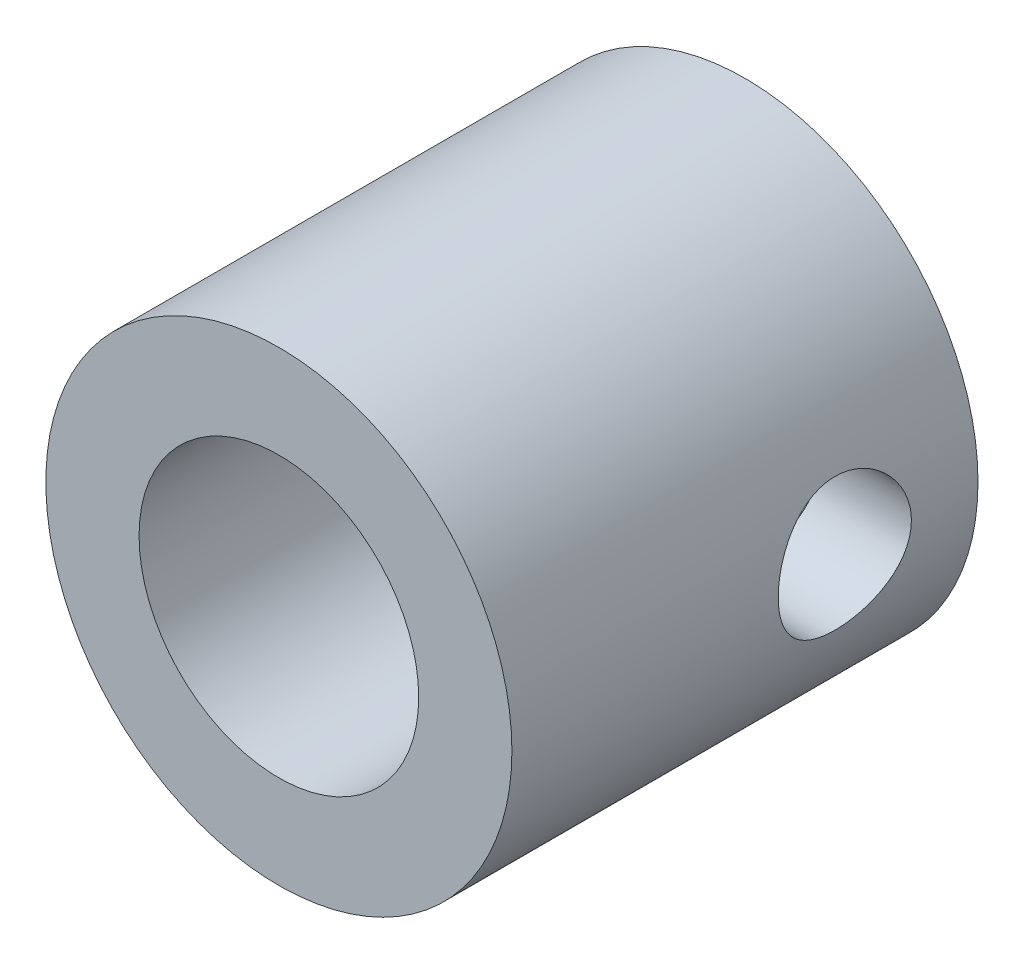
ISO-10303-21;
HEADER;
FILE_DESCRIPTION(('STEP AP214'),'2;1');
FILE_NAME('part.step','',(''),(''),'','','');
FILE_SCHEMA(('AUTOMOTIVE_DESIGN { 1 0 10303 214 1 1 1 1 }'));
ENDSEC;
DATA;
#1=APPLICATION_CONTEXT('core data for automotive mechanical design processes');
#2=APPLICATION_PROTOCOL_DEFINITION('international standard','automotive_design',2000,#1);
#3=PRODUCT_CONTEXT('',#1,'mechanical');
#4=PRODUCT('Part','Part','',(#3));
#5=PRODUCT_RELATED_PRODUCT_CATEGORY('part','',(#4));
#6=PRODUCT_DEFINITION_FORMATION('','',#4);
#7=PRODUCT_DEFINITION_CONTEXT('part definition',#1,'design');
#8=PRODUCT_DEFINITION('design','',#6,#7);
#9=PRODUCT_DEFINITION_SHAPE('','',#8);
#10=(LENGTH_UNIT() NAMED_UNIT(*) SI_UNIT(.MILLI.,.METRE.));
#11=(NAMED_UNIT(*) PLANE_ANGLE_UNIT() SI_UNIT($,.RADIAN.));
#12=(NAMED_UNIT(*) SI_UNIT($,.STERADIAN.) SOLID_ANGLE_UNIT());
#13=UNCERTAINTY_MEASURE_WITH_UNIT(LENGTH_MEASURE(1.E-05),#10,'distance_accuracy_value','');
#14=(GEOMETRIC_REPRESENTATION_CONTEXT(3) GLOBAL_UNCERTAINTY_ASSIGNED_CONTEXT((#13)) GLOBAL_UNIT_ASSIGNED_CONTEXT((#10,
#11,#12)) REPRESENTATION_CONTEXT('',''));
#15=CARTESIAN_POINT('',(0.,0.,0.));
#16=DIRECTION('',(0.,0.,1.));
#17=DIRECTION('',(1.,0.,0.));
#18=AXIS2_PLACEMENT_3D('',#15,#16,#17);
#19=CARTESIAN_POINT('',(0.,0.,7.));
#20=DIRECTION('',(0.,0.,1.));
#21=DIRECTION('',(1.,0.,0.));
#22=AXIS2_PLACEMENT_3D('',#19,#20,#21);
#23=PLANE('',#22);
#24=CARTESIAN_POINT('',(0.,0.,7.));
#25=DIRECTION('',(0.,0.,1.));
#26=DIRECTION('',(1.,0.,0.));
#27=AXIS2_PLACEMENT_3D('',#24,#25,#26);
#28=CIRCLE('',#27,3.5);
#29=CARTESIAN_POINT('',(3.5,0.,7.));
#30=VERTEX_POINT('',#29);
#31=EDGE_CURVE('E10',#30,#30,#28,.T.);
#32=ORIENTED_EDGE('',*,*,#31,.T.);
#33=EDGE_LOOP('',(#32));
#34=FACE_BOUND('',#33,.T.);
#35=CARTESIAN_POINT('',(0.,0.,7.));
#36=DIRECTION('',(0.,0.,1.));
#37=DIRECTION('',(1.,0.,0.));
#38=AXIS2_PLACEMENT_3D('',#35,#36,#37);
#39=CIRCLE('',#38,2.1);
#40=CARTESIAN_POINT('',(2.1,0.,7.));
#41=VERTEX_POINT('',#40);
#42=EDGE_CURVE('E49',#41,#41,#39,.T.);
#43=ORIENTED_EDGE('',*,*,#42,.F.);
#44=EDGE_LOOP('',(#43));
#45=FACE_BOUND('',#44,.T.);
#46=ADVANCED_FACE('F30',(#34,#45),#23,.T.);
#47=CARTESIAN_POINT('',(0.,0.,0.));
#48=DIRECTION('',(0.,0.,1.));
#49=DIRECTION('',(1.,0.,0.));
#50=AXIS2_PLACEMENT_3D('',#47,#48,#49);
#51=PLANE('',#50);
#52=CARTESIAN_POINT('',(0.,0.,0.));
#53=DIRECTION('',(0.,0.,1.));
#54=DIRECTION('',(1.,0.,0.));
#55=AXIS2_PLACEMENT_3D('',#52,#53,#54);
#56=CIRCLE('',#55,3.5);
#57=CARTESIAN_POINT('',(3.5,0.,0.));
#58=VERTEX_POINT('',#57);
#59=EDGE_CURVE('E44',#58,#58,#56,.T.);
#60=ORIENTED_EDGE('',*,*,#59,.F.);
#61=EDGE_LOOP('',(#60));
#62=FACE_BOUND('',#61,.T.);
#63=CARTESIAN_POINT('',(0.,0.,0.));
#64=DIRECTION('',(0.,0.,1.));
#65=DIRECTION('',(1.,0.,0.));
#66=AXIS2_PLACEMENT_3D('',#63,#64,#65);
#67=CIRCLE('',#66,2.1);
#68=CARTESIAN_POINT('',(2.1,0.,0.));
#69=VERTEX_POINT('',#68);
#70=EDGE_CURVE('E52',#69,#69,#67,.T.);
#71=ORIENTED_EDGE('',*,*,#70,.T.);
#72=EDGE_LOOP('',(#71));
#73=FACE_BOUND('',#72,.T.);
#74=ADVANCED_FACE('F88',(#62,#73),#51,.F.);
#75=CARTESIAN_POINT('',(0.,0.,7.));
#76=DIRECTION('',(0.,0.,-1.));
#77=DIRECTION('',(-1.,0.,0.));
#78=AXIS2_PLACEMENT_3D('',#75,#76,#77);
#79=CYLINDRICAL_SURFACE('',#78,3.5);
#80=CARTESIAN_POINT('',(3.5,0.,1.));
#81=CARTESIAN_POINT('',(3.49999934647171,-0.0549774511886257,1.00000096978097));
#82=CARTESIAN_POINT('',(3.49869208701023,-0.109964873936291,1.00454889448806));
#83=CARTESIAN_POINT('',(3.49360452972549,-0.218345995598494,1.02258213505116));
#84=CARTESIAN_POINT('',(3.48982329605034,-0.271739083414807,1.03607083303704));
#85=CARTESIAN_POINT('',(3.48020345674544,-0.375352150368936,1.07150401920825));
#86=CARTESIAN_POINT('',(3.474367720532,-0.425576440424113,1.09343671807598));
#87=CARTESIAN_POINT('',(3.46124989158242,-0.521634380564634,1.14508899573916));
#88=CARTESIAN_POINT('',(3.45396764753901,-0.567467570589077,1.17480938924514));
#89=CARTESIAN_POINT('',(3.43852367312902,-0.654647223429478,1.2420175053365));
#90=CARTESIAN_POINT('',(3.4303452097302,-0.69586186119049,1.27967237692778));
#91=CARTESIAN_POINT('',(3.41413367457396,-0.771485678962155,1.36132387156869));
#92=CARTESIAN_POINT('',(3.40610062478085,-0.805893838538838,1.40532144381557));
#93=CARTESIAN_POINT('',(3.39091507439313,-0.867598950032228,1.49949679139601));
#94=CARTESIAN_POINT('',(3.38378351259108,-0.894739105517028,1.54978099253453));
#95=CARTESIAN_POINT('',(3.37145671914235,-0.940125852769615,1.65443600587328));
#96=CARTESIAN_POINT('',(3.36626107099664,-0.958374357777524,1.7088059360276));
#97=CARTESIAN_POINT('',(3.35856804120241,-0.984992165068876,1.81861738158405));
#98=CARTESIAN_POINT('',(3.35600489366891,-0.993602766016075,1.87399568139911));
#99=CARTESIAN_POINT('',(3.35367104182518,-1.00145333894795,1.98546557424162));
#100=CARTESIAN_POINT('',(3.35389973075333,-1.00069534704803,2.04155700963315));
#101=CARTESIAN_POINT('',(3.35706517184156,-0.990020673813953,2.1509343057268));
#102=CARTESIAN_POINT('',(3.35991391343389,-0.980401628641805,2.20425217559004));
#103=CARTESIAN_POINT('',(3.36785674196985,-0.952756930429097,2.30848360981414));
#104=CARTESIAN_POINT('',(3.37295103189706,-0.934730517406289,2.35939695636034));
#105=CARTESIAN_POINT('',(3.38488431756517,-0.890553405689019,2.45812312221581));
#106=CARTESIAN_POINT('',(3.39174458202416,-0.864302755864395,2.50588853620081));
#107=CARTESIAN_POINT('',(3.40642608441438,-0.804491895839434,2.59643828060673));
#108=CARTESIAN_POINT('',(3.41424753611068,-0.770930058366727,2.63922149886746));
#109=CARTESIAN_POINT('',(3.43033125328062,-0.695951998365101,2.72028618780318));
#110=CARTESIAN_POINT('',(3.43859902286152,-0.654287437422663,2.75833723798361));
#111=CARTESIAN_POINT('',(3.45438123609203,-0.565066141193113,2.82696300182014));
#112=CARTESIAN_POINT('',(3.46189564068921,-0.517509100740946,2.85753732802086));
#113=CARTESIAN_POINT('',(3.47538264032742,-0.417461536545722,2.91046436738702));
#114=CARTESIAN_POINT('',(3.48134637748612,-0.364944908905002,2.93277014340209));
#115=CARTESIAN_POINT('',(3.49099625743795,-0.256696614983734,2.96816694570841));
#116=CARTESIAN_POINT('',(3.49468297428128,-0.200965762905073,2.98126029462264));
#117=CARTESIAN_POINT('',(3.49927437257336,-0.0898331943221745,2.99748664285473));
#118=CARTESIAN_POINT('',(3.50026636425301,-0.0344806734302533,3.00093234768651));
#119=CARTESIAN_POINT('',(3.49961042353544,0.0760132634027913,2.99863636684948));
#120=CARTESIAN_POINT('',(3.49796280790308,0.131154703878553,2.99289578357704));
#121=CARTESIAN_POINT('',(3.49226963342609,0.238509316715159,2.97264477784187));
#122=CARTESIAN_POINT('',(3.48827306508862,0.290759105867428,2.95831340933829));
#123=CARTESIAN_POINT('',(3.4783399937092,0.392104343102815,2.92149974900768));
#124=CARTESIAN_POINT('',(3.47240326632854,0.441199425624337,2.89901651455539));
#125=CARTESIAN_POINT('',(3.45904980584657,0.536020842560038,2.84598833167738));
#126=CARTESIAN_POINT('',(3.45160381589488,0.581651243270127,2.81527940058711));
#127=CARTESIAN_POINT('',(3.43608973548903,0.667219264029655,2.74687374702468));
#128=CARTESIAN_POINT('',(3.42802150376367,0.707155585421215,2.70917543496857));
#129=CARTESIAN_POINT('',(3.41184309815947,0.781553214170353,2.6263953289744));
#130=CARTESIAN_POINT('',(3.40374018433795,0.81579271370477,2.58111236221715));
#131=CARTESIAN_POINT('',(3.38869447362751,0.876197658032581,2.48526870569099));
#132=CARTESIAN_POINT('',(3.3817516363796,0.902363383738855,2.43470819962679));
#133=CARTESIAN_POINT('',(3.36989325638715,0.945687270594171,2.32995439450412));
#134=CARTESIAN_POINT('',(3.36496700079018,0.962893166212216,2.27578211821366));
#135=CARTESIAN_POINT('',(3.35771228398834,0.987897250353704,2.16514503217281));
#136=CARTESIAN_POINT('',(3.35538303564047,0.995698289511611,2.108680922449));
#137=CARTESIAN_POINT('',(3.35365851547575,1.00149012123096,1.99735198353923));
#138=CARTESIAN_POINT('',(3.35415580399703,0.999840138221142,1.94250724772371));
#139=CARTESIAN_POINT('',(3.35777298607399,0.987623554788215,1.83391263466711));
#140=CARTESIAN_POINT('',(3.36089279211716,0.977057251899602,1.7801627209535));
#141=CARTESIAN_POINT('',(3.36933488579116,0.947529844083143,1.67581081441624));
#142=CARTESIAN_POINT('',(3.37463438524179,0.928655458931764,1.62518230649456));
#143=CARTESIAN_POINT('',(3.38683651421364,0.883114746507969,1.52777063275376));
#144=CARTESIAN_POINT('',(3.3937394274128,0.856447040215778,1.48098814936335));
#145=CARTESIAN_POINT('',(3.40865834474881,0.795032732674125,1.39090823909738));
#146=CARTESIAN_POINT('',(3.41670381589509,0.760046138613656,1.34777930432903));
#147=CARTESIAN_POINT('',(3.43284922546139,0.683429920189678,1.26788805209508));
#148=CARTESIAN_POINT('',(3.4409491770859,0.64179862536428,1.2311273404446));
#149=CARTESIAN_POINT('',(3.45653979786176,0.551787160432695,1.16408140783669));
#150=CARTESIAN_POINT('',(3.46400950518705,0.503261251179891,1.13398650636519));
#151=CARTESIAN_POINT('',(3.47725697888987,0.401625264823331,1.082427107489));
#152=CARTESIAN_POINT('',(3.48303566935144,0.34851771205737,1.06095789403347));
#153=CARTESIAN_POINT('',(3.49163672362653,0.246458157667517,1.02957622430228));
#154=CARTESIAN_POINT('',(3.49474842181038,0.197881503812195,1.01851323165772));
#155=CARTESIAN_POINT('',(3.49893021926074,0.0995391843931834,1.00372517137893));
#156=CARTESIAN_POINT('',(3.50000059166997,0.0497736788080458,0.999999122011558));
#157=CARTESIAN_POINT('',(3.5,0.,1.));
#158=B_SPLINE_CURVE_WITH_KNOTS('',3,(#80,#81,#82,#83,#84,#85,#86,#87,#88,#89,#90,#91,#92,#93,
#94,#95,#96,#97,#98,#99,#100,#101,#102,#103,#104,#105,#106,#107,#108,#109,#110,#111,#112,#113,
#114,#115,#116,#117,#118,#119,#120,#121,#122,#123,#124,#125,#126,#127,#128,#129,#130,#131,#132,
#133,#134,#135,#136,#137,#138,#139,#140,#141,#142,#143,#144,#145,#146,#147,#148,#149,#150,#151,
#152,#153,#154,#155,#156,#157),.UNSPECIFIED.,.T.,.F.,(4,2,2,2,2,2,2,2,2,2,2,2,2,2,2,2,2,2,2,2,2,
2,2,2,2,2,2,2,2,2,2,2,2,2,2,2,2,2,4),(0.,0.164749656271172,0.32956166989759,0.494144406447671,
0.658744367717579,0.827239057653907,0.995758989368567,1.16766537650029,1.33953475772405,
1.50699754929408,1.67442394611628,1.83642392910678,1.99843855889074,2.16250401641616,
2.32660602784683,2.49689250297262,2.66718780073736,2.83843550548235,3.00964002003317,
3.17522728845111,3.34079468713335,3.50302570235771,3.66527548283776,3.83103762668237,
3.99683751589905,4.16806052438178,4.3392775747866,4.50957286677749,4.6798165288708,
4.84363340801449,5.00744482086202,5.16958548138845,5.33175484992001,5.49933828438395,
5.66696391547449,5.83888989478295,6.01072174610257,6.15989734012186,6.30905297207072),.UNSPECIFIED.);
#159=CARTESIAN_POINT('',(3.5,0.,1.));
#160=VERTEX_POINT('',#159);
#161=EDGE_CURVE('E72',#160,#160,#158,.T.);
#162=ORIENTED_EDGE('',*,*,#161,.T.);
#163=EDGE_LOOP('',(#162));
#164=FACE_BOUND('',#163,.T.);
#165=CARTESIAN_POINT('',(-3.5,0.,1.));
#166=CARTESIAN_POINT('',(-3.49999934647171,0.0549774511886257,1.00000096978097));
#167=CARTESIAN_POINT('',(-3.49869208701023,0.109964873936291,1.00454889448806));
#168=CARTESIAN_POINT('',(-3.49360452972549,0.218345995598494,1.02258213505116));
#169=CARTESIAN_POINT('',(-3.48982329605034,0.271739083414807,1.03607083303704));
#170=CARTESIAN_POINT('',(-3.48020345674544,0.375352150368936,1.07150401920825));
#171=CARTESIAN_POINT('',(-3.474367720532,0.425576440424113,1.09343671807598));
#172=CARTESIAN_POINT('',(-3.46124989158242,0.521634380564634,1.14508899573916));
#173=CARTESIAN_POINT('',(-3.45396764753901,0.567467570589077,1.17480938924514));
#174=CARTESIAN_POINT('',(-3.43852367312902,0.654647223429478,1.2420175053365));
#175=CARTESIAN_POINT('',(-3.4303452097302,0.69586186119049,1.27967237692778));
#176=CARTESIAN_POINT('',(-3.41413367457396,0.771485678962155,1.36132387156869));
#177=CARTESIAN_POINT('',(-3.40610062478085,0.805893838538838,1.40532144381557));
#178=CARTESIAN_POINT('',(-3.39091507439313,0.867598950032228,1.49949679139601));
#179=CARTESIAN_POINT('',(-3.38378351259108,0.894739105517028,1.54978099253453));
#180=CARTESIAN_POINT('',(-3.37145671914235,0.940125852769615,1.65443600587328));
#181=CARTESIAN_POINT('',(-3.36626107099664,0.958374357777524,1.7088059360276));
#182=CARTESIAN_POINT('',(-3.35856804120241,0.984992165068876,1.81861738158405));
#183=CARTESIAN_POINT('',(-3.35600489366891,0.993602766016075,1.87399568139911));
#184=CARTESIAN_POINT('',(-3.35367104182518,1.00145333894795,1.98546557424162));
#185=CARTESIAN_POINT('',(-3.35389973075333,1.00069534704803,2.04155700963315));
#186=CARTESIAN_POINT('',(-3.35706517184156,0.990020673813953,2.1509343057268));
#187=CARTESIAN_POINT('',(-3.35991391343389,0.980401628641805,2.20425217559004));
#188=CARTESIAN_POINT('',(-3.36785674196985,0.952756930429097,2.30848360981414));
#189=CARTESIAN_POINT('',(-3.37295103189706,0.934730517406289,2.35939695636034));
#190=CARTESIAN_POINT('',(-3.38488431756517,0.890553405689019,2.45812312221581));
#191=CARTESIAN_POINT('',(-3.39174458202416,0.864302755864395,2.50588853620081));
#192=CARTESIAN_POINT('',(-3.40642608441438,0.804491895839434,2.59643828060673));
#193=CARTESIAN_POINT('',(-3.41424753611068,0.770930058366727,2.63922149886746));
#194=CARTESIAN_POINT('',(-3.43033125328062,0.695951998365101,2.72028618780318));
#195=CARTESIAN_POINT('',(-3.43859902286152,0.654287437422663,2.75833723798361));
#196=CARTESIAN_POINT('',(-3.45438123609203,0.565066141193113,2.82696300182014));
#197=CARTESIAN_POINT('',(-3.46189564068921,0.517509100740946,2.85753732802086));
#198=CARTESIAN_POINT('',(-3.47538264032742,0.417461536545722,2.91046436738702));
#199=CARTESIAN_POINT('',(-3.48134637748612,0.364944908905002,2.93277014340209));
#200=CARTESIAN_POINT('',(-3.49099625743795,0.256696614983734,2.96816694570841));
#201=CARTESIAN_POINT('',(-3.49468297428128,0.200965762905073,2.98126029462264));
#202=CARTESIAN_POINT('',(-3.49927437257336,0.0898331943221745,2.99748664285473));
#203=CARTESIAN_POINT('',(-3.50026636425301,0.0344806734302533,3.00093234768651));
#204=CARTESIAN_POINT('',(-3.49961042353544,-0.0760132634027913,2.99863636684948));
#205=CARTESIAN_POINT('',(-3.49796280790308,-0.131154703878553,2.99289578357704));
#206=CARTESIAN_POINT('',(-3.49226963342609,-0.238509316715159,2.97264477784187));
#207=CARTESIAN_POINT('',(-3.48827306508862,-0.290759105867428,2.95831340933829));
#208=CARTESIAN_POINT('',(-3.4783399937092,-0.392104343102815,2.92149974900768));
#209=CARTESIAN_POINT('',(-3.47240326632854,-0.441199425624337,2.89901651455539));
#210=CARTESIAN_POINT('',(-3.45904980584657,-0.536020842560038,2.84598833167738));
#211=CARTESIAN_POINT('',(-3.45160381589488,-0.581651243270127,2.81527940058711));
#212=CARTESIAN_POINT('',(-3.43608973548903,-0.667219264029655,2.74687374702468));
#213=CARTESIAN_POINT('',(-3.42802150376367,-0.707155585421215,2.70917543496857));
#214=CARTESIAN_POINT('',(-3.41184309815947,-0.781553214170353,2.6263953289744));
#215=CARTESIAN_POINT('',(-3.40374018433795,-0.81579271370477,2.58111236221715));
#216=CARTESIAN_POINT('',(-3.38869447362751,-0.876197658032581,2.48526870569099));
#217=CARTESIAN_POINT('',(-3.3817516363796,-0.902363383738855,2.43470819962679));
#218=CARTESIAN_POINT('',(-3.36989325638715,-0.945687270594171,2.32995439450412));
#219=CARTESIAN_POINT('',(-3.36496700079018,-0.962893166212216,2.27578211821366));
#220=CARTESIAN_POINT('',(-3.35771228398834,-0.987897250353704,2.16514503217281));
#221=CARTESIAN_POINT('',(-3.35538303564047,-0.995698289511611,2.108680922449));
#222=CARTESIAN_POINT('',(-3.35365851547575,-1.00149012123096,1.99735198353923));
#223=CARTESIAN_POINT('',(-3.35415580399703,-0.999840138221142,1.94250724772371));
#224=CARTESIAN_POINT('',(-3.35777298607399,-0.987623554788215,1.83391263466711));
#225=CARTESIAN_POINT('',(-3.36089279211716,-0.977057251899602,1.7801627209535));
#226=CARTESIAN_POINT('',(-3.36933488579116,-0.947529844083143,1.67581081441624));
#227=CARTESIAN_POINT('',(-3.37463438524179,-0.928655458931764,1.62518230649456));
#228=CARTESIAN_POINT('',(-3.38683651421364,-0.883114746507969,1.52777063275376));
#229=CARTESIAN_POINT('',(-3.3937394274128,-0.856447040215778,1.48098814936335));
#230=CARTESIAN_POINT('',(-3.40865834474881,-0.795032732674125,1.39090823909738));
#231=CARTESIAN_POINT('',(-3.41670381589509,-0.760046138613656,1.34777930432903));
#232=CARTESIAN_POINT('',(-3.43284922546139,-0.683429920189678,1.26788805209508));
#233=CARTESIAN_POINT('',(-3.4409491770859,-0.64179862536428,1.2311273404446));
#234=CARTESIAN_POINT('',(-3.45653979786176,-0.551787160432695,1.16408140783669));
#235=CARTESIAN_POINT('',(-3.46400950518705,-0.503261251179891,1.13398650636519));
#236=CARTESIAN_POINT('',(-3.47725697888987,-0.401625264823331,1.082427107489));
#237=CARTESIAN_POINT('',(-3.48303566935144,-0.34851771205737,1.06095789403347));
#238=CARTESIAN_POINT('',(-3.49163672362653,-0.246458157667517,1.02957622430228));
#239=CARTESIAN_POINT('',(-3.49474842181038,-0.197881503812195,1.01851323165772));
#240=CARTESIAN_POINT('',(-3.49893021926074,-0.0995391843931834,1.00372517137893));
#241=CARTESIAN_POINT('',(-3.50000059166997,-0.0497736788080458,0.999999122011558));
#242=CARTESIAN_POINT('',(-3.5,0.,1.));
#243=B_SPLINE_CURVE_WITH_KNOTS('',3,(#165,#166,#167,#168,#169,#170,#171,#172,#173,#174,#175,
#176,#177,#178,#179,#180,#181,#182,#183,#184,#185,#186,#187,#188,#189,#190,#191,#192,#193,#194,
#195,#196,#197,#198,#199,#200,#201,#202,#203,#204,#205,#206,#207,#208,#209,#210,#211,#212,#213,
#214,#215,#216,#217,#218,#219,#220,#221,#222,#223,#224,#225,#226,#227,#228,#229,#230,#231,#232,
#233,#234,#235,#236,#237,#238,#239,#240,#241,#242),.UNSPECIFIED.,.T.,.F.,(4,2,2,2,2,2,2,2,2,2,2,
2,2,2,2,2,2,2,2,2,2,2,2,2,2,2,2,2,2,2,2,2,2,2,2,2,2,2,4),(0.,0.164749656271172,0.32956166989759,
0.494144406447671,0.658744367717579,0.827239057653907,0.995758989368567,1.16766537650029,
1.33953475772405,1.50699754929408,1.67442394611628,1.83642392910678,1.99843855889074,
2.16250401641616,2.32660602784683,2.49689250297262,2.66718780073736,2.83843550548235,
3.00964002003317,3.17522728845111,3.34079468713335,3.50302570235771,3.66527548283776,
3.83103762668237,3.99683751589905,4.16806052438178,4.3392775747866,4.50957286677749,
4.6798165288708,4.84363340801449,5.00744482086202,5.16958548138845,5.33175484992001,
5.49933828438395,5.66696391547449,5.83888989478295,6.01072174610257,6.15989734012186,
6.30905297207072),.UNSPECIFIED.);
#244=CARTESIAN_POINT('',(-3.5,0.,1.));
#245=VERTEX_POINT('',#244);
#246=EDGE_CURVE('E77',#245,#245,#243,.T.);
#247=ORIENTED_EDGE('',*,*,#246,.T.);
#248=EDGE_LOOP('',(#247));
#249=FACE_BOUND('',#248,.T.);
#250=ORIENTED_EDGE('',*,*,#31,.F.);
#251=EDGE_LOOP('',(#250));
#252=FACE_BOUND('',#251,.T.);
#253=ORIENTED_EDGE('',*,*,#59,.T.);
#254=EDGE_LOOP('',(#253));
#255=FACE_BOUND('',#254,.T.);
#256=ADVANCED_FACE('F32',(#164,#249,#252,#255),#79,.T.);
#257=CARTESIAN_POINT('',(0.,0.,7.));
#258=DIRECTION('',(0.,0.,-1.));
#259=DIRECTION('',(-1.,0.,0.));
#260=AXIS2_PLACEMENT_3D('',#257,#258,#259);
#261=CYLINDRICAL_SURFACE('',#260,2.1);
#262=CARTESIAN_POINT('',(-2.1,0.,3.));
#263=CARTESIAN_POINT('',(-2.09999742406759,-0.0528674322896795,2.99999696316254));
#264=CARTESIAN_POINT('',(-2.09798176332344,-0.105806642323487,2.99578285701902));
#265=CARTESIAN_POINT('',(-2.09011785290161,-0.210139009078173,2.97910407276701));
#266=CARTESIAN_POINT('',(-2.08426144412697,-0.261528630289095,2.96662182966644));
#267=CARTESIAN_POINT('',(-2.06933290071755,-0.361090074424935,2.93399543597471));
#268=CARTESIAN_POINT('',(-2.06027285689787,-0.409273197521841,2.91388007288556));
#269=CARTESIAN_POINT('',(-2.03978311356581,-0.501518237596379,2.86669819300362));
#270=CARTESIAN_POINT('',(-2.02835375052314,-0.545580738460346,2.83963266308177));
#271=CARTESIAN_POINT('',(-2.00343955348892,-0.631130249036462,2.77757470142248));
#272=CARTESIAN_POINT('',(-1.98987516330252,-0.672331997687729,2.74222138867118));
#273=CARTESIAN_POINT('',(-1.96250309457438,-0.748479781236886,2.66536302884032));
#274=CARTESIAN_POINT('',(-1.94869525603531,-0.78342151979573,2.62385379229936));
#275=CARTESIAN_POINT('',(-1.92131706437864,-0.848451712763158,2.53243483581863));
#276=CARTESIAN_POINT('',(-1.90782799481497,-0.878042738999303,2.48214416713347));
#277=CARTESIAN_POINT('',(-1.8839271354606,-0.928222198507268,2.37657987630755));
#278=CARTESIAN_POINT('',(-1.87351331270363,-0.948816583562614,2.32130957775808));
#279=CARTESIAN_POINT('',(-1.85782914260312,-0.979157491162501,2.21059978799995));
#280=CARTESIAN_POINT('',(-1.85229905076479,-0.989456292078013,2.1553501703452));
#281=CARTESIAN_POINT('',(-1.8462955623464,-1.00061855076247,2.04365266810316));
#282=CARTESIAN_POINT('',(-1.84581795013373,-1.00148987454035,1.98720582186094));
#283=CARTESIAN_POINT('',(-1.84976083842787,-0.994180198792009,1.8811312480496));
#284=CARTESIAN_POINT('',(-1.85366778403128,-0.986948440325628,1.83141463189236));
#285=CARTESIAN_POINT('',(-1.86504921048128,-0.965266691405661,1.7340096209807));
#286=CARTESIAN_POINT('',(-1.8725246644321,-0.950814732009806,1.68632178332377));
#287=CARTESIAN_POINT('',(-1.8903723545173,-0.91482352280354,1.59298736171418));
#288=CARTESIAN_POINT('',(-1.90080782080844,-0.893127504684834,1.5474138831128));
#289=CARTESIAN_POINT('',(-1.92339673999313,-0.843380334718318,1.4603459615675));
#290=CARTESIAN_POINT('',(-1.93555095143768,-0.815326373543508,1.41885333344922));
#291=CARTESIAN_POINT('',(-1.96187989015348,-0.749936121103695,1.33616262960016));
#292=CARTESIAN_POINT('',(-1.97612730195561,-0.711907406306768,1.29553342920332));
#293=CARTESIAN_POINT('',(-2.0039048905805,-0.629488786913099,1.22100566685108));
#294=CARTESIAN_POINT('',(-2.01743478187347,-0.585096375588397,1.18710976982787));
#295=CARTESIAN_POINT('',(-2.04289340968324,-0.489025686844515,1.12580214202039));
#296=CARTESIAN_POINT('',(-2.05474047155111,-0.437132740078001,1.09869020955642));
#297=CARTESIAN_POINT('',(-2.07482680031925,-0.328813837981533,1.05379095469755));
#298=CARTESIAN_POINT('',(-2.08306867543911,-0.272391194812944,1.0359968893263));
#299=CARTESIAN_POINT('',(-2.09448195546187,-0.161303019367268,1.01158661503611));
#300=CARTESIAN_POINT('',(-2.09799656229288,-0.106839726771667,1.00421156778956));
#301=CARTESIAN_POINT('',(-2.10071109560049,0.00265715964848151,0.998503776650936));
#302=CARTESIAN_POINT('',(-2.09991279486794,0.0576905098719663,1.00016731751128));
#303=CARTESIAN_POINT('',(-2.09429972467071,0.162751219540003,1.01201500086269));
#304=CARTESIAN_POINT('',(-2.08976502068773,0.212862522865835,1.02160514981447));
#305=CARTESIAN_POINT('',(-2.07747695601489,0.310677645705691,1.04813432576377));
#306=CARTESIAN_POINT('',(-2.06972322490774,0.35838118744695,1.06507419851287));
#307=CARTESIAN_POINT('',(-2.05141782739369,0.451679638163524,1.10631872541451));
#308=CARTESIAN_POINT('',(-2.04078870294221,0.497167290097509,1.13083043353775));
#309=CARTESIAN_POINT('',(-2.01779057765456,0.583542766280122,1.18629530604155));
#310=CARTESIAN_POINT('',(-2.00542081556112,0.624428563778527,1.21725129164259));
#311=CARTESIAN_POINT('',(-1.97883696873268,0.704369113669827,1.28798511787186));
#312=CARTESIAN_POINT('',(-1.96455742357251,0.742920062405842,1.32830891956051));
#313=CARTESIAN_POINT('',(-1.93664636229379,0.812910593403708,1.41495285300709));
#314=CARTESIAN_POINT('',(-1.9230151962072,0.84434636814578,1.46127617452187));
#315=CARTESIAN_POINT('',(-1.89749926349884,0.900265530264604,1.56080083591167));
#316=CARTESIAN_POINT('',(-1.88569690978008,0.924451558117571,1.61419215644224));
#317=CARTESIAN_POINT('',(-1.86618519970031,0.963240317630038,1.72503602035426));
#318=CARTESIAN_POINT('',(-1.85847109494298,0.977854171800971,1.78248376399017));
#319=CARTESIAN_POINT('',(-1.84889349240394,0.995834938717165,1.89412647612757));
#320=CARTESIAN_POINT('',(-1.84655646158115,1.00011397806312,1.94813352081453));
#321=CARTESIAN_POINT('',(-1.84668304421407,0.999881509936704,2.05611496678284));
#322=CARTESIAN_POINT('',(-1.84914513497926,0.995372790690605,2.11008937298466));
#323=CARTESIAN_POINT('',(-1.8581089908649,0.978523967587735,2.21201123833289));
#324=CARTESIAN_POINT('',(-1.86427675518114,0.966829718634654,2.26009825337259));
#325=CARTESIAN_POINT('',(-1.87960117426923,0.93668756488974,2.35359707187656));
#326=CARTESIAN_POINT('',(-1.88875873454711,0.918237613822875,2.39900805993967));
#327=CARTESIAN_POINT('',(-1.90978279699245,0.87371229050318,2.48920713942614));
#328=CARTESIAN_POINT('',(-1.92178942533949,0.847209756728986,2.53375084205707));
#329=CARTESIAN_POINT('',(-1.94688195872916,0.787838169645444,2.61803832301268));
#330=CARTESIAN_POINT('',(-1.95996838547135,0.754966028425828,2.65777975802136));
#331=CARTESIAN_POINT('',(-1.98741083152487,0.67968136432292,2.73571098674326));
#332=CARTESIAN_POINT('',(-2.00175412052986,0.636626456066684,2.77328799609552));
#333=CARTESIAN_POINT('',(-2.02878504621711,0.544370591586977,2.84078944070965));
#334=CARTESIAN_POINT('',(-2.04147187124476,0.495166645319849,2.87071013127477));
#335=CARTESIAN_POINT('',(-2.06378343175614,0.391895310377006,2.9218079584849));
#336=CARTESIAN_POINT('',(-2.07341496504284,0.337839066723882,2.94300453737834));
#337=CARTESIAN_POINT('',(-2.088509361953,0.226417985448019,2.97574872332964));
#338=CARTESIAN_POINT('',(-2.0939844802602,0.169063414714213,2.98732470518621));
#339=CARTESIAN_POINT('',(-2.0980362756342,0.0926776127922026,2.99587019624324));
#340=CARTESIAN_POINT('',(-2.0987710849776,0.0741865516398701,2.99741706169634));
#341=CARTESIAN_POINT('',(-2.09975340524356,0.0371332804220404,2.9994825088841));
#342=CARTESIAN_POINT('',(-2.10000090486365,0.0185710687163098,3.00000106676861));
#343=CARTESIAN_POINT('',(-2.1,0.,3.));
#344=B_SPLINE_CURVE_WITH_KNOTS('',3,(#262,#263,#264,#265,#266,#267,#268,#269,#270,#271,#272,
#273,#274,#275,#276,#277,#278,#279,#280,#281,#282,#283,#284,#285,#286,#287,#288,#289,#290,#291,
#292,#293,#294,#295,#296,#297,#298,#299,#300,#301,#302,#303,#304,#305,#306,#307,#308,#309,#310,
#311,#312,#313,#314,#315,#316,#317,#318,#319,#320,#321,#322,#323,#324,#325,#326,#327,#328,#329,
#330,#331,#332,#333,#334,#335,#336,#337,#338,#339,#340,#341,#342,#343),.UNSPECIFIED.,.T.,.F.,(4,
2,2,2,2,2,2,2,2,2,2,2,2,2,2,2,2,2,2,2,2,2,2,2,2,2,2,2,2,2,2,2,2,2,2,2,2,2,2,2,4),(0.,
0.158526561678301,0.317390985055067,0.475662128730361,0.633910811519276,0.801081412492405,
0.968366309275943,1.14712796358446,1.3257711772608,1.49421362035356,1.66251550918978,
1.81298717246268,1.96349989163803,2.1175073628448,2.27158301708112,2.44316092828875,
2.61480661253877,2.79305906497902,2.97118234419533,3.13551312487464,3.29977636366259,
3.45274013380175,3.60572151054531,3.76332503366529,3.92099769919581,4.09299481030247,
4.26508374519124,4.44348586053924,4.6216803097537,4.78345796768453,4.9451843043048,
5.09415249773086,5.24316585040028,5.40213651479749,5.5611844399797,5.73711973165683,
5.9131409093146,6.08876766014594,6.26387456394555,6.31955987459956,6.37524647678135),.UNSPECIFIED.);
#345=CARTESIAN_POINT('',(-2.1,0.,3.));
#346=VERTEX_POINT('',#345);
#347=EDGE_CURVE('E35',#346,#346,#344,.T.);
#348=ORIENTED_EDGE('',*,*,#347,.F.);
#349=EDGE_LOOP('',(#348));
#350=FACE_BOUND('',#349,.T.);
#351=CARTESIAN_POINT('',(2.1,0.,1.));
#352=CARTESIAN_POINT('',(2.09999742406759,-0.0528674322896795,1.00000303683746));
#353=CARTESIAN_POINT('',(2.09798176332344,-0.105806642323487,1.00421714298098));
#354=CARTESIAN_POINT('',(2.09011785290161,-0.210139009078173,1.02089592723299));
#355=CARTESIAN_POINT('',(2.08426144412697,-0.261528630289095,1.03337817033356));
#356=CARTESIAN_POINT('',(2.06933290071755,-0.361090074424935,1.06600456402529));
#357=CARTESIAN_POINT('',(2.06027285689787,-0.409273197521841,1.08611992711444));
#358=CARTESIAN_POINT('',(2.03978311356581,-0.501518237596379,1.13330180699638));
#359=CARTESIAN_POINT('',(2.02835375052314,-0.545580738460346,1.16036733691823));
#360=CARTESIAN_POINT('',(2.00343955348892,-0.631130249036462,1.22242529857752));
#361=CARTESIAN_POINT('',(1.98987516330252,-0.672331997687729,1.25777861132882));
#362=CARTESIAN_POINT('',(1.96250309457438,-0.748479781236887,1.33463697115968));
#363=CARTESIAN_POINT('',(1.94869525603531,-0.783421519795731,1.37614620770064));
#364=CARTESIAN_POINT('',(1.92131706437864,-0.848451712763158,1.46756516418137));
#365=CARTESIAN_POINT('',(1.90782799481497,-0.878042738999303,1.51785583286653));
#366=CARTESIAN_POINT('',(1.8839271354606,-0.928222198507269,1.62342012369245));
#367=CARTESIAN_POINT('',(1.87351331270363,-0.948816583562614,1.67869042224192));
#368=CARTESIAN_POINT('',(1.85782914260312,-0.979157491162501,1.78940021200005));
#369=CARTESIAN_POINT('',(1.85229905076479,-0.989456292078013,1.8446498296548));
#370=CARTESIAN_POINT('',(1.8462955623464,-1.00061855076247,1.95634733189684));
#371=CARTESIAN_POINT('',(1.84581795013373,-1.00148987454035,2.01279417813906));
#372=CARTESIAN_POINT('',(1.84976083842787,-0.994180198792009,2.1188687519504));
#373=CARTESIAN_POINT('',(1.85366778403128,-0.986948440325628,2.16858536810764));
#374=CARTESIAN_POINT('',(1.86504921048128,-0.96526669140566,2.2659903790193));
#375=CARTESIAN_POINT('',(1.8725246644321,-0.950814732009806,2.31367821667623));
#376=CARTESIAN_POINT('',(1.8903723545173,-0.91482352280354,2.40701263828582));
#377=CARTESIAN_POINT('',(1.90080782080844,-0.893127504684834,2.4525861168872));
#378=CARTESIAN_POINT('',(1.92339673999313,-0.843380334718317,2.5396540384325));
#379=CARTESIAN_POINT('',(1.93555095143768,-0.815326373543508,2.58114666655078));
#380=CARTESIAN_POINT('',(1.96187989015348,-0.749936121103694,2.66383737039984));
#381=CARTESIAN_POINT('',(1.97612730195561,-0.711907406306767,2.70446657079668));
#382=CARTESIAN_POINT('',(2.0039048905805,-0.629488786913099,2.77899433314892));
#383=CARTESIAN_POINT('',(2.01743478187347,-0.585096375588397,2.81289023017213));
#384=CARTESIAN_POINT('',(2.04289340968324,-0.489025686844514,2.87419785797961));
#385=CARTESIAN_POINT('',(2.05474047155111,-0.437132740078001,2.90130979044358));
#386=CARTESIAN_POINT('',(2.07482680031925,-0.328813837981533,2.94620904530245));
#387=CARTESIAN_POINT('',(2.08306867543911,-0.272391194812944,2.9640031106737));
#388=CARTESIAN_POINT('',(2.09448195546187,-0.161303019367268,2.98841338496389));
#389=CARTESIAN_POINT('',(2.09799656229288,-0.106839726771666,2.99578843221044));
#390=CARTESIAN_POINT('',(2.10071109560049,0.00265715964848209,3.00149622334906));
#391=CARTESIAN_POINT('',(2.09991279486794,0.0576905098719668,2.99983268248872));
#392=CARTESIAN_POINT('',(2.09429972467071,0.162751219540004,2.98798499913731));
#393=CARTESIAN_POINT('',(2.08976502068773,0.212862522865836,2.97839485018553));
#394=CARTESIAN_POINT('',(2.07747695601489,0.310677645705692,2.95186567423623));
#395=CARTESIAN_POINT('',(2.06972322490774,0.358381187446951,2.93492580148713));
#396=CARTESIAN_POINT('',(2.05141782739369,0.451679638163524,2.89368127458549));
#397=CARTESIAN_POINT('',(2.04078870294221,0.497167290097509,2.86916956646225));
#398=CARTESIAN_POINT('',(2.01779057765456,0.583542766280122,2.81370469395845));
#399=CARTESIAN_POINT('',(2.00542081556112,0.624428563778527,2.78274870835741));
#400=CARTESIAN_POINT('',(1.97883696873268,0.704369113669827,2.71201488212814));
#401=CARTESIAN_POINT('',(1.96455742357251,0.742920062405842,2.67169108043949));
#402=CARTESIAN_POINT('',(1.93664636229379,0.812910593403708,2.58504714699291));
#403=CARTESIAN_POINT('',(1.9230151962072,0.84434636814578,2.53872382547813));
#404=CARTESIAN_POINT('',(1.89749926349884,0.900265530264604,2.43919916408833));
#405=CARTESIAN_POINT('',(1.88569690978008,0.924451558117571,2.38580784355775));
#406=CARTESIAN_POINT('',(1.86618519970031,0.963240317630038,2.27496397964574));
#407=CARTESIAN_POINT('',(1.85847109494298,0.977854171800971,2.21751623600983));
#408=CARTESIAN_POINT('',(1.84889349240394,0.995834938717165,2.10587352387243));
#409=CARTESIAN_POINT('',(1.84655646158115,1.00011397806312,2.05186647918547));
#410=CARTESIAN_POINT('',(1.84668304421407,0.999881509936704,1.94388503321716));
#411=CARTESIAN_POINT('',(1.84914513497926,0.995372790690605,1.88991062701534));
#412=CARTESIAN_POINT('',(1.8581089908649,0.978523967587734,1.78798876166711));
#413=CARTESIAN_POINT('',(1.86427675518114,0.966829718634654,1.73990174662741));
#414=CARTESIAN_POINT('',(1.87960117426923,0.93668756488974,1.64640292812344));
#415=CARTESIAN_POINT('',(1.88875873454711,0.918237613822874,1.60099194006032));
#416=CARTESIAN_POINT('',(1.90978279699245,0.87371229050318,1.51079286057386));
#417=CARTESIAN_POINT('',(1.92178942533949,0.847209756728985,1.46624915794293));
#418=CARTESIAN_POINT('',(1.94688195872916,0.787838169645443,1.38196167698732));
#419=CARTESIAN_POINT('',(1.95996838547135,0.754966028425828,1.34222024197864));
#420=CARTESIAN_POINT('',(1.98741083152487,0.67968136432292,1.26428901325674));
#421=CARTESIAN_POINT('',(2.00175412052986,0.636626456066684,1.22671200390448));
#422=CARTESIAN_POINT('',(2.02878504621711,0.544370591586977,1.15921055929035));
#423=CARTESIAN_POINT('',(2.04147187124476,0.495166645319849,1.12928986872522));
#424=CARTESIAN_POINT('',(2.06378343175614,0.391895310377006,1.0781920415151));
#425=CARTESIAN_POINT('',(2.07341496504284,0.337839066723883,1.05699546262166));
#426=CARTESIAN_POINT('',(2.088509361953,0.226417985448019,1.02425127667036));
#427=CARTESIAN_POINT('',(2.0939844802602,0.169063414714213,1.01267529481379));
#428=CARTESIAN_POINT('',(2.0980362756342,0.0926776127922026,1.00412980375676));
#429=CARTESIAN_POINT('',(2.0987710849776,0.0741865516398701,1.00258293830366));
#430=CARTESIAN_POINT('',(2.09975340524356,0.0371332804220404,1.0005174911159));
#431=CARTESIAN_POINT('',(2.10000090486365,0.0185710687163098,0.999998933231392));
#432=CARTESIAN_POINT('',(2.1,0.,1.));
#433=B_SPLINE_CURVE_WITH_KNOTS('',3,(#351,#352,#353,#354,#355,#356,#357,#358,#359,#360,#361,
#362,#363,#364,#365,#366,#367,#368,#369,#370,#371,#372,#373,#374,#375,#376,#377,#378,#379,#380,
#381,#382,#383,#384,#385,#386,#387,#388,#389,#390,#391,#392,#393,#394,#395,#396,#397,#398,#399,
#400,#401,#402,#403,#404,#405,#406,#407,#408,#409,#410,#411,#412,#413,#414,#415,#416,#417,#418,
#419,#420,#421,#422,#423,#424,#425,#426,#427,#428,#429,#430,#431,#432),.UNSPECIFIED.,.T.,.F.,(4,
2,2,2,2,2,2,2,2,2,2,2,2,2,2,2,2,2,2,2,2,2,2,2,2,2,2,2,2,2,2,2,2,2,2,2,2,2,2,2,4),(0.,
0.158526561678301,0.317390985055067,0.475662128730361,0.633910811519277,0.801081412492406,
0.968366309275944,1.14712796358446,1.3257711772608,1.49421362035356,1.66251550918978,
1.81298717246268,1.96349989163803,2.1175073628448,2.27158301708112,2.44316092828875,
2.61480661253877,2.79305906497902,2.97118234419533,3.13551312487464,3.29977636366259,
3.45274013380175,3.60572151054531,3.76332503366529,3.92099769919581,4.09299481030247,
4.26508374519124,4.44348586053925,4.6216803097537,4.78345796768453,4.9451843043048,
5.09415249773086,5.24316585040028,5.40213651479749,5.5611844399797,5.73711973165683,
5.9131409093146,6.08876766014594,6.26387456394555,6.31955987459956,6.37524647678135),.UNSPECIFIED.);
#434=CARTESIAN_POINT('',(2.1,0.,1.));
#435=VERTEX_POINT('',#434);
#436=EDGE_CURVE('E54',#435,#435,#433,.T.);
#437=ORIENTED_EDGE('',*,*,#436,.F.);
#438=EDGE_LOOP('',(#437));
#439=FACE_BOUND('',#438,.T.);
#440=ORIENTED_EDGE('',*,*,#42,.T.);
#441=EDGE_LOOP('',(#440));
#442=FACE_BOUND('',#441,.T.);
#443=ORIENTED_EDGE('',*,*,#70,.F.);
#444=EDGE_LOOP('',(#443));
#445=FACE_BOUND('',#444,.T.);
#446=ADVANCED_FACE('F59',(#350,#439,#442,#445),#261,.F.);
#447=CARTESIAN_POINT('',(-3.5,0.,2.));
#448=DIRECTION('',(1.,0.,0.));
#449=DIRECTION('',(0.,0.,-1.));
#450=AXIS2_PLACEMENT_3D('',#447,#448,#449);
#451=CYLINDRICAL_SURFACE('',#450,1.);
#452=ORIENTED_EDGE('',*,*,#436,.T.);
#453=EDGE_LOOP('',(#452));
#454=FACE_BOUND('',#453,.T.);
#455=ORIENTED_EDGE('',*,*,#161,.F.);
#456=EDGE_LOOP('',(#455));
#457=FACE_BOUND('',#456,.T.);
#458=ADVANCED_FACE('F65',(#454,#457),#451,.F.);
#459=ORIENTED_EDGE('',*,*,#347,.T.);
#460=EDGE_LOOP('',(#459));
#461=FACE_BOUND('',#460,.T.);
#462=ORIENTED_EDGE('',*,*,#246,.F.);
#463=EDGE_LOOP('',(#462));
#464=FACE_BOUND('',#463,.T.);
#465=ADVANCED_FACE('F62',(#461,#464),#451,.F.);
#466=CLOSED_SHELL('',(#46,#74,#256,#446,#458,#465));
#467=MANIFOLD_SOLID_BREP('B2',#466);
#468=ADVANCED_BREP_SHAPE_REPRESENTATION('',(#18,#467),#14);
#469=SHAPE_DEFINITION_REPRESENTATION(#9,#468);
ENDSEC;
END-ISO-10303-21;
